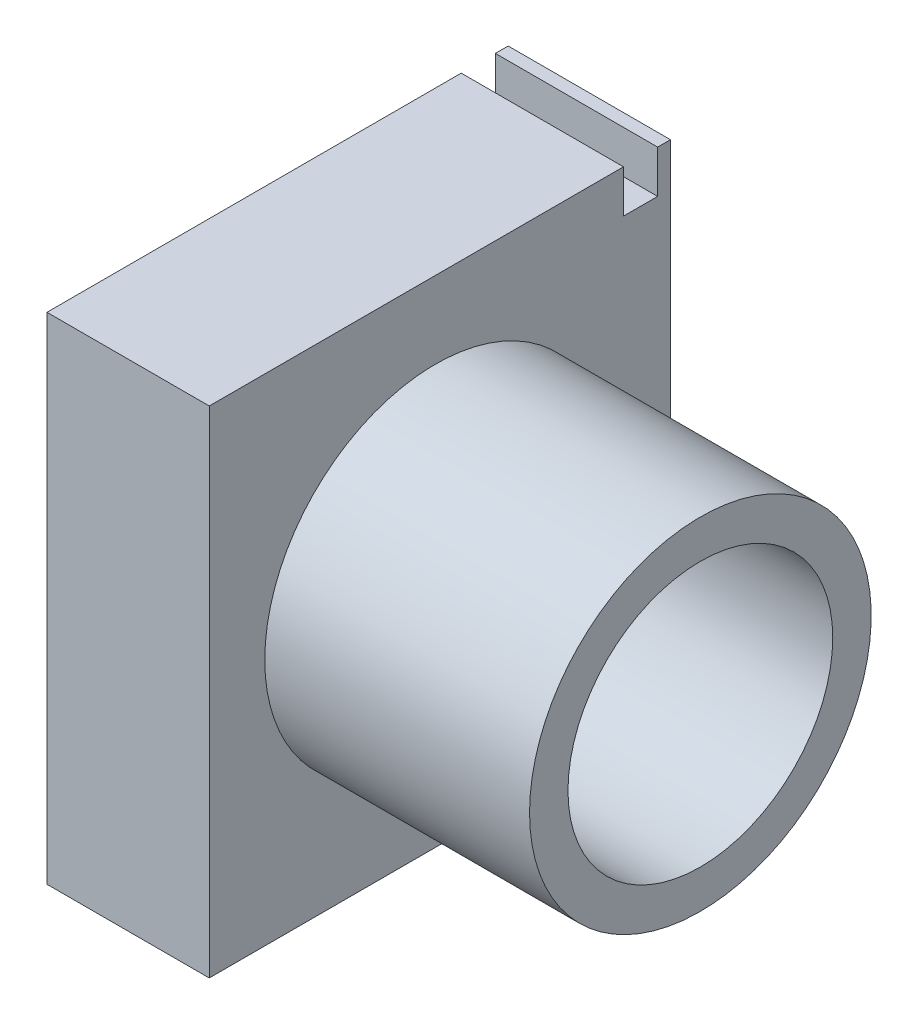
ISO-10303-21;
HEADER;
FILE_DESCRIPTION(('STEP AP214'),'2;1');
FILE_NAME('part.step','',(''),(''),'','','');
FILE_SCHEMA(('AUTOMOTIVE_DESIGN { 1 0 10303 214 1 1 1 1 }'));
ENDSEC;
DATA;
#1=APPLICATION_CONTEXT('core data for automotive mechanical design processes');
#2=APPLICATION_PROTOCOL_DEFINITION('international standard','automotive_design',2000,#1);
#3=PRODUCT_CONTEXT('',#1,'mechanical');
#4=PRODUCT('Part','Part','',(#3));
#5=PRODUCT_RELATED_PRODUCT_CATEGORY('part','',(#4));
#6=PRODUCT_DEFINITION_FORMATION('','',#4);
#7=PRODUCT_DEFINITION_CONTEXT('part definition',#1,'design');
#8=PRODUCT_DEFINITION('design','',#6,#7);
#9=PRODUCT_DEFINITION_SHAPE('','',#8);
#10=(LENGTH_UNIT() NAMED_UNIT(*) SI_UNIT(.MILLI.,.METRE.));
#11=(NAMED_UNIT(*) PLANE_ANGLE_UNIT() SI_UNIT($,.RADIAN.));
#12=(NAMED_UNIT(*) SI_UNIT($,.STERADIAN.) SOLID_ANGLE_UNIT());
#13=UNCERTAINTY_MEASURE_WITH_UNIT(LENGTH_MEASURE(1.E-05),#10,'distance_accuracy_value','');
#14=(GEOMETRIC_REPRESENTATION_CONTEXT(3) GLOBAL_UNCERTAINTY_ASSIGNED_CONTEXT((#13)) GLOBAL_UNIT_ASSIGNED_CONTEXT((#10,
#11,#12)) REPRESENTATION_CONTEXT('',''));
#15=CARTESIAN_POINT('',(0.,0.,0.));
#16=DIRECTION('',(0.,0.,1.));
#17=DIRECTION('',(1.,0.,0.));
#18=AXIS2_PLACEMENT_3D('',#15,#16,#17);
#19=CARTESIAN_POINT('',(0.,58.,54.));
#20=DIRECTION('',(0.,-1.,0.));
#21=DIRECTION('',(0.,0.,-1.));
#22=AXIS2_PLACEMENT_3D('',#19,#20,#21);
#23=PLANE('',#22);
#24=DIRECTION('',(0.,0.,1.));
#25=VECTOR('',#24,1.);
#26=CARTESIAN_POINT('',(0.,58.,54.));
#27=LINE('',#26,#25);
#28=CARTESIAN_POINT('',(0.,58.,0.));
#29=VERTEX_POINT('',#28);
#30=CARTESIAN_POINT('',(0.,58.,1.5));
#31=VERTEX_POINT('',#30);
#32=EDGE_CURVE('E213',#29,#31,#27,.T.);
#33=ORIENTED_EDGE('',*,*,#32,.T.);
#34=DIRECTION('',(-1.,0.,0.));
#35=VECTOR('',#34,1.);
#36=CARTESIAN_POINT('',(0.,58.,1.5));
#37=LINE('',#36,#35);
#38=CARTESIAN_POINT('',(19.,58.,1.5));
#39=VERTEX_POINT('',#38);
#40=EDGE_CURVE('E181',#39,#31,#37,.T.);
#41=ORIENTED_EDGE('',*,*,#40,.F.);
#42=DIRECTION('',(0.,0.,-1.));
#43=VECTOR('',#42,1.);
#44=CARTESIAN_POINT('',(19.,58.,54.));
#45=LINE('',#44,#43);
#46=CARTESIAN_POINT('',(19.,58.,0.));
#47=VERTEX_POINT('',#46);
#48=EDGE_CURVE('E179',#39,#47,#45,.T.);
#49=ORIENTED_EDGE('',*,*,#48,.T.);
#50=DIRECTION('',(-1.,0.,0.));
#51=VECTOR('',#50,1.);
#52=CARTESIAN_POINT('',(0.,58.,0.));
#53=LINE('',#52,#51);
#54=EDGE_CURVE('E212',#47,#29,#53,.T.);
#55=ORIENTED_EDGE('',*,*,#54,.T.);
#56=EDGE_LOOP('',(#33,#41,#49,#55));
#57=FACE_BOUND('',#56,.T.);
#58=ADVANCED_FACE('F86',(#57),#23,.F.);
#59=CARTESIAN_POINT('',(0.,0.,0.));
#60=DIRECTION('',(0.,0.,-1.));
#61=DIRECTION('',(-1.,0.,0.));
#62=AXIS2_PLACEMENT_3D('',#59,#60,#61);
#63=PLANE('',#62);
#64=DIRECTION('',(0.,1.,0.));
#65=VECTOR('',#64,1.);
#66=CARTESIAN_POINT('',(0.,0.,0.));
#67=LINE('',#66,#65);
#68=CARTESIAN_POINT('',(0.,10.,0.));
#69=VERTEX_POINT('',#68);
#70=EDGE_CURVE('E218',#69,#29,#67,.T.);
#71=ORIENTED_EDGE('',*,*,#70,.T.);
#72=ORIENTED_EDGE('',*,*,#54,.F.);
#73=DIRECTION('',(0.,1.,0.));
#74=VECTOR('',#73,1.);
#75=CARTESIAN_POINT('',(19.,58.,0.));
#76=LINE('',#75,#74);
#77=CARTESIAN_POINT('',(19.,9.99999999999999,0.));
#78=VERTEX_POINT('',#77);
#79=EDGE_CURVE('E201',#78,#47,#76,.T.);
#80=ORIENTED_EDGE('',*,*,#79,.F.);
#81=DIRECTION('',(1.,0.,0.));
#82=VECTOR('',#81,1.);
#83=CARTESIAN_POINT('',(0.,10.,0.));
#84=LINE('',#83,#82);
#85=EDGE_CURVE('E225',#78,#69,#84,.F.);
#86=ORIENTED_EDGE('',*,*,#85,.T.);
#87=EDGE_LOOP('',(#71,#72,#80,#86));
#88=FACE_BOUND('',#87,.T.);
#89=ADVANCED_FACE('F323',(#88),#63,.T.);
#90=CARTESIAN_POINT('',(19.,0.,54.));
#91=DIRECTION('',(0.,1.,0.));
#92=DIRECTION('',(-1.,0.,0.));
#93=AXIS2_PLACEMENT_3D('',#90,#91,#92);
#94=PLANE('',#93);
#95=DIRECTION('',(0.,0.,-1.));
#96=VECTOR('',#95,1.);
#97=CARTESIAN_POINT('',(0.,0.,54.));
#98=LINE('',#97,#96);
#99=CARTESIAN_POINT('',(0.,0.,54.));
#100=VERTEX_POINT('',#99);
#101=CARTESIAN_POINT('',(0.,0.,10.));
#102=VERTEX_POINT('',#101);
#103=EDGE_CURVE('E270',#100,#102,#98,.T.);
#104=ORIENTED_EDGE('',*,*,#103,.T.);
#105=DIRECTION('',(1.,0.,0.));
#106=VECTOR('',#105,1.);
#107=CARTESIAN_POINT('',(19.,0.,10.));
#108=LINE('',#107,#106);
#109=CARTESIAN_POINT('',(19.,0.,10.));
#110=VERTEX_POINT('',#109);
#111=EDGE_CURVE('E258',#102,#110,#108,.T.);
#112=ORIENTED_EDGE('',*,*,#111,.T.);
#113=DIRECTION('',(0.,0.,-1.));
#114=VECTOR('',#113,1.);
#115=CARTESIAN_POINT('',(19.,0.,54.));
#116=LINE('',#115,#114);
#117=CARTESIAN_POINT('',(19.,0.,54.));
#118=VERTEX_POINT('',#117);
#119=EDGE_CURVE('E290',#118,#110,#116,.T.);
#120=ORIENTED_EDGE('',*,*,#119,.F.);
#121=DIRECTION('',(1.,0.,0.));
#122=VECTOR('',#121,1.);
#123=CARTESIAN_POINT('',(19.,0.,54.));
#124=LINE('',#123,#122);
#125=EDGE_CURVE('E259',#100,#118,#124,.T.);
#126=ORIENTED_EDGE('',*,*,#125,.F.);
#127=EDGE_LOOP('',(#104,#112,#120,#126));
#128=FACE_BOUND('',#127,.T.);
#129=ADVANCED_FACE('F304',(#128),#94,.F.);
#130=CARTESIAN_POINT('',(19.,58.,54.));
#131=DIRECTION('',(-1.,0.,0.));
#132=DIRECTION('',(0.,-1.,0.));
#133=AXIS2_PLACEMENT_3D('',#130,#131,#132);
#134=PLANE('',#133);
#135=CARTESIAN_POINT('',(19.,29.,27.5));
#136=DIRECTION('',(-1.,0.,0.));
#137=DIRECTION('',(0.,-1.,0.));
#138=AXIS2_PLACEMENT_3D('',#135,#136,#137);
#139=CIRCLE('',#138,20.);
#140=CARTESIAN_POINT('',(19.,9.00000000000001,27.5));
#141=VERTEX_POINT('',#140);
#142=EDGE_CURVE('E254',#141,#141,#139,.T.);
#143=ORIENTED_EDGE('',*,*,#142,.T.);
#144=EDGE_LOOP('',(#143));
#145=FACE_BOUND('',#144,.T.);
#146=ORIENTED_EDGE('',*,*,#48,.F.);
#147=DIRECTION('',(0.,1.,0.));
#148=VECTOR('',#147,1.);
#149=CARTESIAN_POINT('',(19.,33.5835121610524,1.5));
#150=LINE('',#149,#148);
#151=CARTESIAN_POINT('',(19.,53.,1.5));
#152=VERTEX_POINT('',#151);
#153=EDGE_CURVE('E161',#152,#39,#150,.T.);
#154=ORIENTED_EDGE('',*,*,#153,.F.);
#155=DIRECTION('',(0.,0.,-1.));
#156=VECTOR('',#155,1.);
#157=CARTESIAN_POINT('',(19.,53.,1.5));
#158=LINE('',#157,#156);
#159=CARTESIAN_POINT('',(19.,53.,5.5));
#160=VERTEX_POINT('',#159);
#161=EDGE_CURVE('E166',#160,#152,#158,.T.);
#162=ORIENTED_EDGE('',*,*,#161,.F.);
#163=DIRECTION('',(0.,1.,0.));
#164=VECTOR('',#163,1.);
#165=CARTESIAN_POINT('',(19.,33.5835121610524,5.5));
#166=LINE('',#165,#164);
#167=CARTESIAN_POINT('',(19.,58.,5.5));
#168=VERTEX_POINT('',#167);
#169=EDGE_CURVE('E187',#160,#168,#166,.T.);
#170=ORIENTED_EDGE('',*,*,#169,.T.);
#171=CARTESIAN_POINT('',(19.,58.,54.));
#172=VERTEX_POINT('',#171);
#173=EDGE_CURVE('E197',#172,#168,#45,.T.);
#174=ORIENTED_EDGE('',*,*,#173,.F.);
#175=DIRECTION('',(0.,1.,0.));
#176=VECTOR('',#175,1.);
#177=CARTESIAN_POINT('',(19.,58.,54.));
#178=LINE('',#177,#176);
#179=EDGE_CURVE('E263',#118,#172,#178,.T.);
#180=ORIENTED_EDGE('',*,*,#179,.F.);
#181=ORIENTED_EDGE('',*,*,#119,.T.);
#182=CARTESIAN_POINT('',(19.,9.99999999999999,10.));
#183=DIRECTION('',(-1.,0.,0.));
#184=DIRECTION('',(0.,-1.,0.));
#185=AXIS2_PLACEMENT_3D('',#182,#183,#184);
#186=CIRCLE('',#185,10.);
#187=EDGE_CURVE('E207',#110,#78,#186,.F.);
#188=ORIENTED_EDGE('',*,*,#187,.T.);
#189=ORIENTED_EDGE('',*,*,#79,.T.);
#190=EDGE_LOOP('',(#146,#154,#162,#170,#174,#180,#181,#188,#189));
#191=FACE_BOUND('',#190,.T.);
#192=ADVANCED_FACE('F177',(#145,#191),#134,.F.);
#193=ORIENTED_EDGE('',*,*,#173,.T.);
#194=DIRECTION('',(1.,0.,0.));
#195=VECTOR('',#194,1.);
#196=CARTESIAN_POINT('',(19.,58.,5.5));
#197=LINE('',#196,#195);
#198=CARTESIAN_POINT('',(0.,58.,5.5));
#199=VERTEX_POINT('',#198);
#200=EDGE_CURVE('E12',#199,#168,#197,.T.);
#201=ORIENTED_EDGE('',*,*,#200,.F.);
#202=DIRECTION('',(0.,0.,-1.));
#203=VECTOR('',#202,1.);
#204=CARTESIAN_POINT('',(0.,58.,54.));
#205=LINE('',#204,#203);
#206=CARTESIAN_POINT('',(0.,58.,54.));
#207=VERTEX_POINT('',#206);
#208=EDGE_CURVE('E90',#207,#199,#205,.T.);
#209=ORIENTED_EDGE('',*,*,#208,.F.);
#210=DIRECTION('',(-1.,0.,0.));
#211=VECTOR('',#210,1.);
#212=CARTESIAN_POINT('',(0.,58.,54.));
#213=LINE('',#212,#211);
#214=EDGE_CURVE('E266',#172,#207,#213,.T.);
#215=ORIENTED_EDGE('',*,*,#214,.F.);
#216=EDGE_LOOP('',(#193,#201,#209,#215));
#217=FACE_BOUND('',#216,.T.);
#218=ADVANCED_FACE('F297',(#217),#23,.F.);
#219=CARTESIAN_POINT('',(0.,0.,54.));
#220=DIRECTION('',(1.,0.,0.));
#221=DIRECTION('',(0.,0.,-1.));
#222=AXIS2_PLACEMENT_3D('',#219,#220,#221);
#223=PLANE('',#222);
#224=CARTESIAN_POINT('',(0.,29.,9.25000000000001));
#225=DIRECTION('',(-1.,0.,0.));
#226=DIRECTION('',(0.,0.,1.));
#227=AXIS2_PLACEMENT_3D('',#224,#225,#226);
#228=CIRCLE('',#227,1.9);
#229=CARTESIAN_POINT('',(0.,29.,11.15));
#230=VERTEX_POINT('',#229);
#231=EDGE_CURVE('E229',#230,#230,#228,.T.);
#232=ORIENTED_EDGE('',*,*,#231,.F.);
#233=EDGE_LOOP('',(#232));
#234=FACE_BOUND('',#233,.T.);
#235=CARTESIAN_POINT('',(0.,29.,45.75));
#236=DIRECTION('',(-1.,0.,0.));
#237=DIRECTION('',(0.,0.,1.));
#238=AXIS2_PLACEMENT_3D('',#235,#236,#237);
#239=CIRCLE('',#238,1.9);
#240=CARTESIAN_POINT('',(0.,29.,47.65));
#241=VERTEX_POINT('',#240);
#242=EDGE_CURVE('E237',#241,#241,#239,.T.);
#243=ORIENTED_EDGE('',*,*,#242,.F.);
#244=EDGE_LOOP('',(#243));
#245=FACE_BOUND('',#244,.T.);
#246=ORIENTED_EDGE('',*,*,#103,.F.);
#247=DIRECTION('',(0.,-1.,0.));
#248=VECTOR('',#247,1.);
#249=CARTESIAN_POINT('',(0.,0.,54.));
#250=LINE('',#249,#248);
#251=EDGE_CURVE('E247',#207,#100,#250,.T.);
#252=ORIENTED_EDGE('',*,*,#251,.F.);
#253=ORIENTED_EDGE('',*,*,#208,.T.);
#254=DIRECTION('',(0.,1.,0.));
#255=VECTOR('',#254,1.);
#256=CARTESIAN_POINT('',(0.,33.5835121610524,5.5));
#257=LINE('',#256,#255);
#258=CARTESIAN_POINT('',(0.,53.,5.5));
#259=VERTEX_POINT('',#258);
#260=EDGE_CURVE('E97',#259,#199,#257,.T.);
#261=ORIENTED_EDGE('',*,*,#260,.F.);
#262=DIRECTION('',(0.,0.,-1.));
#263=VECTOR('',#262,1.);
#264=CARTESIAN_POINT('',(0.,53.,54.));
#265=LINE('',#264,#263);
#266=CARTESIAN_POINT('',(0.,53.,1.5));
#267=VERTEX_POINT('',#266);
#268=EDGE_CURVE('E106',#259,#267,#265,.T.);
#269=ORIENTED_EDGE('',*,*,#268,.T.);
#270=DIRECTION('',(0.,1.,0.));
#271=VECTOR('',#270,1.);
#272=CARTESIAN_POINT('',(0.,33.5835121610524,1.5));
#273=LINE('',#272,#271);
#274=EDGE_CURVE('E164',#267,#31,#273,.T.);
#275=ORIENTED_EDGE('',*,*,#274,.T.);
#276=ORIENTED_EDGE('',*,*,#32,.F.);
#277=ORIENTED_EDGE('',*,*,#70,.F.);
#278=CARTESIAN_POINT('',(0.,10.,10.));
#279=DIRECTION('',(1.,0.,0.));
#280=DIRECTION('',(0.,0.,-1.));
#281=AXIS2_PLACEMENT_3D('',#278,#279,#280);
#282=CIRCLE('',#281,10.);
#283=EDGE_CURVE('E191',#69,#102,#282,.F.);
#284=ORIENTED_EDGE('',*,*,#283,.T.);
#285=EDGE_LOOP('',(#246,#252,#253,#261,#269,#275,#276,#277,#284));
#286=FACE_BOUND('',#285,.T.);
#287=ADVANCED_FACE('F299',(#234,#245,#286),#223,.F.);
#288=CARTESIAN_POINT('',(0.,0.,54.));
#289=DIRECTION('',(0.,0.,-1.));
#290=DIRECTION('',(-1.,0.,0.));
#291=AXIS2_PLACEMENT_3D('',#288,#289,#290);
#292=PLANE('',#291);
#293=ORIENTED_EDGE('',*,*,#125,.T.);
#294=ORIENTED_EDGE('',*,*,#179,.T.);
#295=ORIENTED_EDGE('',*,*,#214,.T.);
#296=ORIENTED_EDGE('',*,*,#251,.T.);
#297=EDGE_LOOP('',(#293,#294,#295,#296));
#298=FACE_BOUND('',#297,.T.);
#299=ADVANCED_FACE('F306',(#298),#292,.F.);
#300=CARTESIAN_POINT('',(50.,29.,27.5));
#301=DIRECTION('',(-1.,0.,0.));
#302=DIRECTION('',(0.,0.,1.));
#303=AXIS2_PLACEMENT_3D('',#300,#301,#302);
#304=CYLINDRICAL_SURFACE('',#303,20.);
#305=CARTESIAN_POINT('',(50.,29.,27.5));
#306=DIRECTION('',(-1.,0.,0.));
#307=DIRECTION('',(0.,0.,1.));
#308=AXIS2_PLACEMENT_3D('',#305,#306,#307);
#309=CIRCLE('',#308,20.);
#310=CARTESIAN_POINT('',(50.,29.,47.5));
#311=VERTEX_POINT('',#310);
#312=EDGE_CURVE('E242',#311,#311,#309,.T.);
#313=ORIENTED_EDGE('',*,*,#312,.T.);
#314=EDGE_LOOP('',(#313));
#315=FACE_BOUND('',#314,.T.);
#316=ORIENTED_EDGE('',*,*,#142,.F.);
#317=EDGE_LOOP('',(#316));
#318=FACE_BOUND('',#317,.T.);
#319=ADVANCED_FACE('F308',(#315,#318),#304,.T.);
#320=CARTESIAN_POINT('',(50.,29.,27.5));
#321=DIRECTION('',(-1.,0.,0.));
#322=DIRECTION('',(0.,0.,1.));
#323=AXIS2_PLACEMENT_3D('',#320,#321,#322);
#324=CYLINDRICAL_SURFACE('',#323,15.5);
#325=CARTESIAN_POINT('',(50.,29.,27.5));
#326=DIRECTION('',(-1.,0.,0.));
#327=DIRECTION('',(0.,0.,1.));
#328=AXIS2_PLACEMENT_3D('',#325,#326,#327);
#329=CIRCLE('',#328,15.5);
#330=CARTESIAN_POINT('',(50.,29.,43.));
#331=VERTEX_POINT('',#330);
#332=EDGE_CURVE('E241',#331,#331,#329,.T.);
#333=ORIENTED_EDGE('',*,*,#332,.F.);
#334=EDGE_LOOP('',(#333));
#335=FACE_BOUND('',#334,.T.);
#336=CARTESIAN_POINT('',(19.,29.,27.5));
#337=DIRECTION('',(-1.,0.,0.));
#338=DIRECTION('',(0.,-1.,0.));
#339=AXIS2_PLACEMENT_3D('',#336,#337,#338);
#340=CIRCLE('',#339,15.5);
#341=CARTESIAN_POINT('',(19.,13.5,27.5));
#342=VERTEX_POINT('',#341);
#343=EDGE_CURVE('E246',#342,#342,#340,.T.);
#344=ORIENTED_EDGE('',*,*,#343,.T.);
#345=EDGE_LOOP('',(#344));
#346=FACE_BOUND('',#345,.T.);
#347=ADVANCED_FACE('F315',(#335,#346),#324,.F.);
#348=CARTESIAN_POINT('',(50.,0.,0.));
#349=DIRECTION('',(-1.,0.,0.));
#350=DIRECTION('',(0.,0.,1.));
#351=AXIS2_PLACEMENT_3D('',#348,#349,#350);
#352=PLANE('',#351);
#353=ORIENTED_EDGE('',*,*,#312,.F.);
#354=EDGE_LOOP('',(#353));
#355=FACE_BOUND('',#354,.T.);
#356=ORIENTED_EDGE('',*,*,#332,.T.);
#357=EDGE_LOOP('',(#356));
#358=FACE_BOUND('',#357,.T.);
#359=ADVANCED_FACE('F340',(#355,#358),#352,.F.);
#360=ORIENTED_EDGE('',*,*,#343,.F.);
#361=EDGE_LOOP('',(#360));
#362=FACE_BOUND('',#361,.T.);
#363=ADVANCED_FACE('F333',(#362),#134,.F.);
#364=CARTESIAN_POINT('',(10.,29.,45.75));
#365=DIRECTION('',(-1.,0.,0.));
#366=DIRECTION('',(0.,0.,1.));
#367=AXIS2_PLACEMENT_3D('',#364,#365,#366);
#368=CYLINDRICAL_SURFACE('',#367,1.9);
#369=CARTESIAN_POINT('',(10.,29.,45.75));
#370=DIRECTION('',(-1.,0.,0.));
#371=DIRECTION('',(0.,0.,1.));
#372=AXIS2_PLACEMENT_3D('',#369,#370,#371);
#373=CIRCLE('',#372,1.9);
#374=CARTESIAN_POINT('',(10.,29.,47.65));
#375=VERTEX_POINT('',#374);
#376=EDGE_CURVE('E233',#375,#375,#373,.T.);
#377=ORIENTED_EDGE('',*,*,#376,.F.);
#378=EDGE_LOOP('',(#377));
#379=FACE_BOUND('',#378,.T.);
#380=ORIENTED_EDGE('',*,*,#242,.T.);
#381=EDGE_LOOP('',(#380));
#382=FACE_BOUND('',#381,.T.);
#383=ADVANCED_FACE('F339',(#379,#382),#368,.F.);
#384=CARTESIAN_POINT('',(10.,0.,0.));
#385=DIRECTION('',(-1.,0.,0.));
#386=DIRECTION('',(0.,0.,1.));
#387=AXIS2_PLACEMENT_3D('',#384,#385,#386);
#388=PLANE('',#387);
#389=ORIENTED_EDGE('',*,*,#376,.T.);
#390=EDGE_LOOP('',(#389));
#391=FACE_BOUND('',#390,.T.);
#392=ADVANCED_FACE('F346',(#391),#388,.T.);
#393=CARTESIAN_POINT('',(10.,29.,9.25000000000001));
#394=DIRECTION('',(-1.,0.,0.));
#395=DIRECTION('',(0.,0.,1.));
#396=AXIS2_PLACEMENT_3D('',#393,#394,#395);
#397=CYLINDRICAL_SURFACE('',#396,1.9);
#398=CARTESIAN_POINT('',(10.,29.,9.25000000000001));
#399=DIRECTION('',(-1.,0.,0.));
#400=DIRECTION('',(0.,0.,1.));
#401=AXIS2_PLACEMENT_3D('',#398,#399,#400);
#402=CIRCLE('',#401,1.9);
#403=CARTESIAN_POINT('',(10.,29.,11.15));
#404=VERTEX_POINT('',#403);
#405=EDGE_CURVE('E195',#404,#404,#402,.T.);
#406=ORIENTED_EDGE('',*,*,#405,.F.);
#407=EDGE_LOOP('',(#406));
#408=FACE_BOUND('',#407,.T.);
#409=ORIENTED_EDGE('',*,*,#231,.T.);
#410=EDGE_LOOP('',(#409));
#411=FACE_BOUND('',#410,.T.);
#412=ADVANCED_FACE('F362',(#408,#411),#397,.F.);
#413=CARTESIAN_POINT('',(10.,0.,0.));
#414=DIRECTION('',(-1.,0.,0.));
#415=DIRECTION('',(0.,0.,1.));
#416=AXIS2_PLACEMENT_3D('',#413,#414,#415);
#417=PLANE('',#416);
#418=ORIENTED_EDGE('',*,*,#405,.T.);
#419=EDGE_LOOP('',(#418));
#420=FACE_BOUND('',#419,.T.);
#421=ADVANCED_FACE('F366',(#420),#417,.T.);
#422=CARTESIAN_POINT('',(19.,9.99999999999999,10.));
#423=DIRECTION('',(-1.,0.,0.));
#424=DIRECTION('',(0.,-1.,0.));
#425=AXIS2_PLACEMENT_3D('',#422,#423,#424);
#426=CYLINDRICAL_SURFACE('',#425,10.);
#427=ORIENTED_EDGE('',*,*,#283,.F.);
#428=ORIENTED_EDGE('',*,*,#85,.F.);
#429=ORIENTED_EDGE('',*,*,#187,.F.);
#430=ORIENTED_EDGE('',*,*,#111,.F.);
#431=EDGE_LOOP('',(#427,#428,#429,#430));
#432=FACE_BOUND('',#431,.T.);
#433=ADVANCED_FACE('F303',(#432),#426,.T.);
#434=CARTESIAN_POINT('',(0.,53.,54.));
#435=DIRECTION('',(0.,-1.,0.));
#436=DIRECTION('',(0.,0.,-1.));
#437=AXIS2_PLACEMENT_3D('',#434,#435,#436);
#438=PLANE('',#437);
#439=DIRECTION('',(1.,0.,0.));
#440=VECTOR('',#439,1.);
#441=CARTESIAN_POINT('',(19.,53.,5.5));
#442=LINE('',#441,#440);
#443=EDGE_CURVE('E170',#259,#160,#442,.T.);
#444=ORIENTED_EDGE('',*,*,#443,.T.);
#445=ORIENTED_EDGE('',*,*,#161,.T.);
#446=DIRECTION('',(-1.,0.,0.));
#447=VECTOR('',#446,1.);
#448=CARTESIAN_POINT('',(0.,53.,1.5));
#449=LINE('',#448,#447);
#450=EDGE_CURVE('E157',#152,#267,#449,.T.);
#451=ORIENTED_EDGE('',*,*,#450,.T.);
#452=ORIENTED_EDGE('',*,*,#268,.F.);
#453=EDGE_LOOP('',(#444,#445,#451,#452));
#454=FACE_BOUND('',#453,.T.);
#455=ADVANCED_FACE('F169',(#454),#438,.F.);
#456=CARTESIAN_POINT('',(0.,33.5835121610524,1.5));
#457=DIRECTION('',(0.,0.,-1.));
#458=DIRECTION('',(-1.,0.,0.));
#459=AXIS2_PLACEMENT_3D('',#456,#457,#458);
#460=PLANE('',#459);
#461=ORIENTED_EDGE('',*,*,#153,.T.);
#462=ORIENTED_EDGE('',*,*,#40,.T.);
#463=ORIENTED_EDGE('',*,*,#274,.F.);
#464=ORIENTED_EDGE('',*,*,#450,.F.);
#465=EDGE_LOOP('',(#461,#462,#463,#464));
#466=FACE_BOUND('',#465,.T.);
#467=ADVANCED_FACE('F159',(#466),#460,.F.);
#468=CARTESIAN_POINT('',(19.,33.5835121610524,5.5));
#469=DIRECTION('',(0.,0.,1.));
#470=DIRECTION('',(1.,0.,0.));
#471=AXIS2_PLACEMENT_3D('',#468,#469,#470);
#472=PLANE('',#471);
#473=ORIENTED_EDGE('',*,*,#260,.T.);
#474=ORIENTED_EDGE('',*,*,#200,.T.);
#475=ORIENTED_EDGE('',*,*,#169,.F.);
#476=ORIENTED_EDGE('',*,*,#443,.F.);
#477=EDGE_LOOP('',(#473,#474,#475,#476));
#478=FACE_BOUND('',#477,.T.);
#479=ADVANCED_FACE('F88',(#478),#472,.F.);
#480=CLOSED_SHELL('',(#58,#89,#129,#192,#218,#287,#299,#319,#347,#359,#363,#383,#392,#412,#421,
#433,#455,#467,#479));
#481=MANIFOLD_SOLID_BREP('B2',#480);
#482=ADVANCED_BREP_SHAPE_REPRESENTATION('',(#18,#481),#14);
#483=SHAPE_DEFINITION_REPRESENTATION(#9,#482);
ENDSEC;
END-ISO-10303-21;
